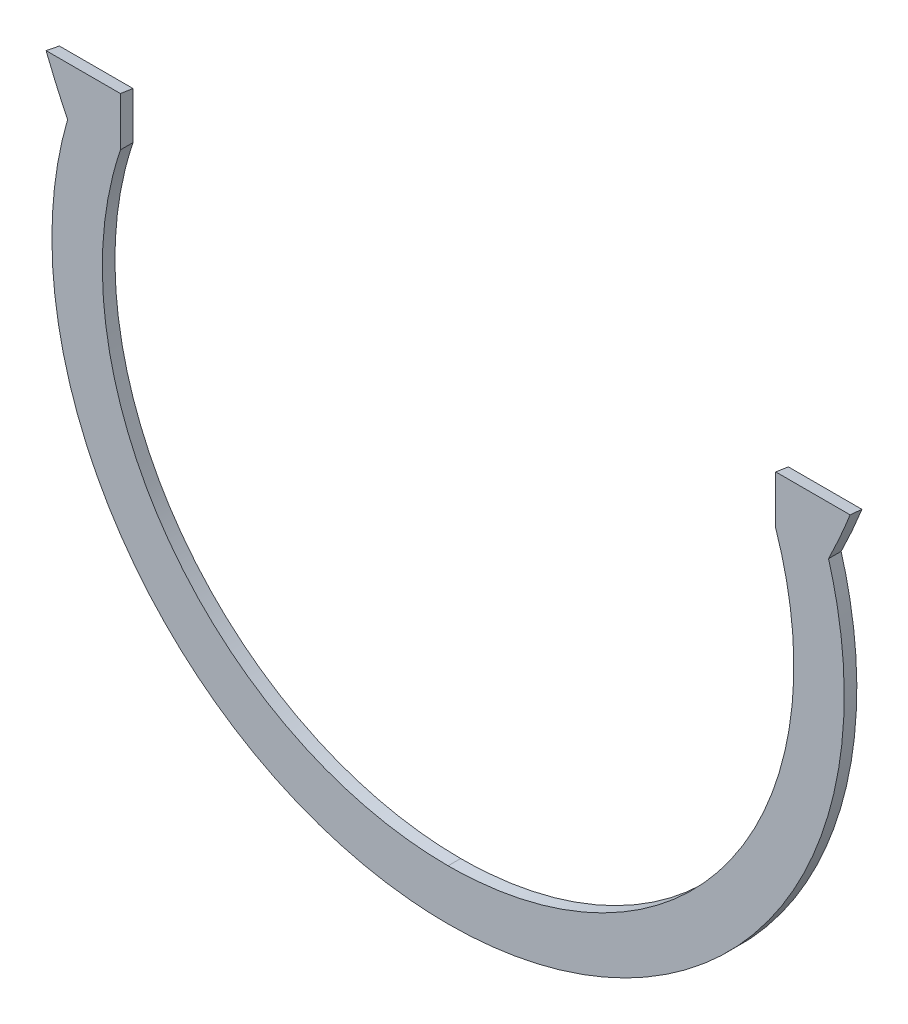
ISO-10303-21;
HEADER;
FILE_DESCRIPTION(('STEP AP214'),'2;1');
FILE_NAME('part.step','',(''),(''),'','','');
FILE_SCHEMA(('AUTOMOTIVE_DESIGN { 1 0 10303 214 1 1 1 1 }'));
ENDSEC;
DATA;
#1=APPLICATION_CONTEXT('core data for automotive mechanical design processes');
#2=APPLICATION_PROTOCOL_DEFINITION('international standard','automotive_design',2000,#1);
#3=PRODUCT_CONTEXT('',#1,'mechanical');
#4=PRODUCT('Part','Part','',(#3));
#5=PRODUCT_RELATED_PRODUCT_CATEGORY('part','',(#4));
#6=PRODUCT_DEFINITION_FORMATION('','',#4);
#7=PRODUCT_DEFINITION_CONTEXT('part definition',#1,'design');
#8=PRODUCT_DEFINITION('design','',#6,#7);
#9=PRODUCT_DEFINITION_SHAPE('','',#8);
#10=(LENGTH_UNIT() NAMED_UNIT(*) SI_UNIT(.MILLI.,.METRE.));
#11=(NAMED_UNIT(*) PLANE_ANGLE_UNIT() SI_UNIT($,.RADIAN.));
#12=(NAMED_UNIT(*) SI_UNIT($,.STERADIAN.) SOLID_ANGLE_UNIT());
#13=UNCERTAINTY_MEASURE_WITH_UNIT(LENGTH_MEASURE(1.E-05),#10,'distance_accuracy_value','');
#14=(GEOMETRIC_REPRESENTATION_CONTEXT(3) GLOBAL_UNCERTAINTY_ASSIGNED_CONTEXT((#13)) GLOBAL_UNIT_ASSIGNED_CONTEXT((#10,
#11,#12)) REPRESENTATION_CONTEXT('',''));
#15=CARTESIAN_POINT('',(0.,0.,0.));
#16=DIRECTION('',(0.,0.,1.));
#17=DIRECTION('',(1.,0.,0.));
#18=AXIS2_PLACEMENT_3D('',#15,#16,#17);
#19=CARTESIAN_POINT('',(330.199999998664,-1904.86157691547,6.35));
#20=CARTESIAN_POINT('',(336.639292378157,-1923.96382584088,6.35));
#21=CARTESIAN_POINT('',(340.832967806029,-1943.68174918712,6.35));
#22=CARTESIAN_POINT('',(345.11624084571,-1963.82094472574,6.35));
#23=CARTESIAN_POINT('',(346.998050476947,-1984.32557625151,6.35));
#24=CARTESIAN_POINT('',(348.90699900396,-2005.12591944157,6.35));
#25=CARTESIAN_POINT('',(348.31740472374,-2026.00652688445,6.35));
#26=CARTESIAN_POINT('',(347.723543780599,-2047.03823910659,6.35));
#27=CARTESIAN_POINT('',(344.603158175214,-2067.84680935807,6.35));
#28=CARTESIAN_POINT('',(341.482937727115,-2088.65427824342,6.35));
#29=CARTESIAN_POINT('',(335.881411340609,-2108.93617534306,6.35));
#30=CARTESIAN_POINT('',(330.320731156412,-2129.07017731287,6.35));
#31=CARTESIAN_POINT('',(322.394206398882,-2148.39675876694,6.35));
#32=CARTESIAN_POINT('',(314.581242610894,-2167.44645401993,6.35));
#33=CARTESIAN_POINT('',(304.578626432106,-2185.44448519148,6.35));
#34=CARTESIAN_POINT('',(294.786215790542,-2203.06428673352,6.35));
#35=CARTESIAN_POINT('',(283.026600810078,-2219.43824890162,6.35));
#36=CARTESIAN_POINT('',(271.267654299251,-2235.81128029974,6.35));
#37=CARTESIAN_POINT('',(257.698302157418,-2250.71992192202,6.35));
#38=CARTESIAN_POINT('',(243.839238238036,-2265.94686975523,6.35));
#39=CARTESIAN_POINT('',(228.282491996413,-2279.43645087925,6.35));
#40=CARTESIAN_POINT('',(212.501391273664,-2293.12057448193,6.35));
#41=CARTESIAN_POINT('',(195.197604421026,-2304.82212706519,6.35));
#42=CARTESIAN_POINT('',(177.768593620015,-2316.60836137906,6.35));
#43=CARTESIAN_POINT('',(159.047015178597,-2326.21230617433,6.35));
#44=CARTESIAN_POINT('',(140.326422651031,-2335.81574520764,6.35));
#45=CARTESIAN_POINT('',(120.585280622746,-2343.09720593272,6.35));
#46=CARTESIAN_POINT('',(100.988090120464,-2350.32557057139,6.35));
#47=CARTESIAN_POINT('',(80.666622119461,-2355.16132813832,6.35));
#48=CARTESIAN_POINT('',(60.636297431214,-2359.92780436801,6.35));
#49=CARTESIAN_POINT('',(40.182855313118,-2362.30230481868,6.35));
#50=CARTESIAN_POINT('',(20.1589610124713,-2364.6269377957,6.35));
#51=CARTESIAN_POINT('',(-4.10782519111308E-12,-2364.6269377957,6.35));
#52=B_SPLINE_CURVE_WITH_KNOTS('',2,(#19,#20,#21,#22,#23,#24,#25,#26,#27,#28,#29,#30,#31,#32,#33,
#34,#35,#36,#37,#38,#39,#40,#41,#42,#43,#44,#45,#46,#47,#48,#49,#50,#51),.UNSPECIFIED.,.F.,.F.,
(3,2,2,2,2,2,2,2,2,2,2,2,2,2,2,2,3),(0.,0.0625,0.125,0.1875,0.25,0.3125,0.375,0.4375,0.5,0.5625,
0.625,0.6875,0.75,0.8125,0.875,0.9375,1.),.UNSPECIFIED.);
#53=DIRECTION('',(0.,0.,-1.));
#54=VECTOR('',#53,1.);
#55=SURFACE_OF_LINEAR_EXTRUSION('',#52,#54);
#56=CARTESIAN_POINT('',(330.199999998664,-1904.86157691547,-6.35));
#57=CARTESIAN_POINT('',(336.639292378157,-1923.96382584088,-6.35));
#58=CARTESIAN_POINT('',(340.832967806029,-1943.68174918712,-6.35));
#59=CARTESIAN_POINT('',(345.11624084571,-1963.82094472574,-6.35));
#60=CARTESIAN_POINT('',(346.998050476947,-1984.32557625151,-6.35));
#61=CARTESIAN_POINT('',(348.90699900396,-2005.12591944157,-6.35));
#62=CARTESIAN_POINT('',(348.31740472374,-2026.00652688445,-6.35));
#63=CARTESIAN_POINT('',(347.723543780599,-2047.03823910659,-6.35));
#64=CARTESIAN_POINT('',(344.603158175214,-2067.84680935807,-6.35));
#65=CARTESIAN_POINT('',(341.482937727115,-2088.65427824342,-6.35));
#66=CARTESIAN_POINT('',(335.881411340609,-2108.93617534306,-6.35));
#67=CARTESIAN_POINT('',(330.320731156412,-2129.07017731287,-6.35));
#68=CARTESIAN_POINT('',(322.394206398882,-2148.39675876694,-6.35));
#69=CARTESIAN_POINT('',(314.581242610894,-2167.44645401993,-6.35));
#70=CARTESIAN_POINT('',(304.578626432106,-2185.44448519148,-6.35));
#71=CARTESIAN_POINT('',(294.786215790542,-2203.06428673352,-6.35));
#72=CARTESIAN_POINT('',(283.026600810078,-2219.43824890162,-6.35));
#73=CARTESIAN_POINT('',(271.267654299251,-2235.81128029974,-6.35));
#74=CARTESIAN_POINT('',(257.698302157418,-2250.71992192202,-6.35));
#75=CARTESIAN_POINT('',(243.839238238036,-2265.94686975523,-6.35));
#76=CARTESIAN_POINT('',(228.282491996413,-2279.43645087925,-6.35));
#77=CARTESIAN_POINT('',(212.501391273664,-2293.12057448193,-6.35));
#78=CARTESIAN_POINT('',(195.197604421026,-2304.82212706519,-6.35));
#79=CARTESIAN_POINT('',(177.768593620015,-2316.60836137906,-6.35));
#80=CARTESIAN_POINT('',(159.047015178597,-2326.21230617433,-6.35));
#81=CARTESIAN_POINT('',(140.326422651031,-2335.81574520764,-6.35));
#82=CARTESIAN_POINT('',(120.585280622746,-2343.09720593272,-6.35));
#83=CARTESIAN_POINT('',(100.988090120464,-2350.32557057139,-6.35));
#84=CARTESIAN_POINT('',(80.666622119461,-2355.16132813832,-6.35));
#85=CARTESIAN_POINT('',(60.636297431214,-2359.92780436801,-6.35));
#86=CARTESIAN_POINT('',(40.182855313118,-2362.30230481868,-6.35));
#87=CARTESIAN_POINT('',(20.1589610124713,-2364.6269377957,-6.35));
#88=CARTESIAN_POINT('',(-4.10782519111308E-12,-2364.6269377957,-6.35));
#89=B_SPLINE_CURVE_WITH_KNOTS('',2,(#56,#57,#58,#59,#60,#61,#62,#63,#64,#65,#66,#67,#68,#69,#70,
#71,#72,#73,#74,#75,#76,#77,#78,#79,#80,#81,#82,#83,#84,#85,#86,#87,#88),.UNSPECIFIED.,.F.,.F.,
(3,2,2,2,2,2,2,2,2,2,2,2,2,2,2,2,3),(0.,0.0625,0.125,0.1875,0.25,0.3125,0.375,0.4375,0.5,0.5625,
0.625,0.6875,0.75,0.8125,0.875,0.9375,1.),.UNSPECIFIED.);
#90=CARTESIAN_POINT('',(330.199999998664,-1904.86157691547,-6.35));
#91=VERTEX_POINT('',#90);
#92=CARTESIAN_POINT('',(-4.21884749357559E-12,-2364.6269377957,-6.35));
#93=VERTEX_POINT('',#92);
#94=EDGE_CURVE('E258',#91,#93,#89,.T.);
#95=ORIENTED_EDGE('',*,*,#94,.T.);
#96=DIRECTION('',(0.,0.,-1.));
#97=VECTOR('',#96,1.);
#98=CARTESIAN_POINT('',(-4.21884749357559E-12,-2364.6269377957,6.35));
#99=LINE('',#98,#97);
#100=CARTESIAN_POINT('',(-4.21884749357559E-12,-2364.6269377957,6.35));
#101=VERTEX_POINT('',#100);
#102=EDGE_CURVE('E261',#101,#93,#99,.T.);
#103=ORIENTED_EDGE('',*,*,#102,.F.);
#104=CARTESIAN_POINT('',(330.199999998664,-1904.86157691547,6.35));
#105=VERTEX_POINT('',#104);
#106=EDGE_CURVE('E314',#105,#101,#52,.T.);
#107=ORIENTED_EDGE('',*,*,#106,.F.);
#108=DIRECTION('',(0.,0.,-1.));
#109=VECTOR('',#108,1.);
#110=CARTESIAN_POINT('',(330.199999998664,-1904.86157691547,6.35));
#111=LINE('',#110,#109);
#112=EDGE_CURVE('E263',#105,#91,#111,.T.);
#113=ORIENTED_EDGE('',*,*,#112,.T.);
#114=EDGE_LOOP('',(#95,#103,#107,#113));
#115=FACE_BOUND('',#114,.T.);
#116=ADVANCED_FACE('F36',(#115),#55,.F.);
#117=CARTESIAN_POINT('',(-4.21884749357559E-12,-2364.6269377957,6.35));
#118=CARTESIAN_POINT('',(-20.1583828890401,-2364.6269377957,6.35));
#119=CARTESIAN_POINT('',(-40.1828553131254,-2362.30230481868,6.35));
#120=CARTESIAN_POINT('',(-60.6351510161924,-2359.9280060087,6.35));
#121=CARTESIAN_POINT('',(-80.666622119468,-2355.16132813831,6.35));
#122=CARTESIAN_POINT('',(-100.986982990005,-2350.32590621745,6.35));
#123=CARTESIAN_POINT('',(-120.585280622753,-2343.09720593272,6.35));
#124=CARTESIAN_POINT('',(-140.325401863207,-2335.81619496403,6.35));
#125=CARTESIAN_POINT('',(-159.047015178604,-2326.21230617433,6.35));
#126=CARTESIAN_POINT('',(-177.767635503069,-2316.60892677312,6.35));
#127=CARTESIAN_POINT('',(-195.197604421033,-2304.82212706519,6.35));
#128=CARTESIAN_POINT('',(-212.500474341294,-2293.12127647376,6.35));
#129=CARTESIAN_POINT('',(-228.28249199642,-2279.43645087925,6.35));
#130=CARTESIAN_POINT('',(-243.838405798299,-2265.94768334687,6.35));
#131=CARTESIAN_POINT('',(-257.698302157424,-2250.71992192201,6.35));
#132=CARTESIAN_POINT('',(-271.266932458057,-2235.81217227322,6.35));
#133=CARTESIAN_POINT('',(-283.026600810083,-2219.43824890162,6.35));
#134=CARTESIAN_POINT('',(-294.785599992276,-2203.06525726851,6.35));
#135=CARTESIAN_POINT('',(-304.578626432111,-2185.44448519148,6.35));
#136=CARTESIAN_POINT('',(-314.58073730018,-2167.44750366813,6.35));
#137=CARTESIAN_POINT('',(-322.394206398886,-2148.39675876694,6.35));
#138=CARTESIAN_POINT('',(-330.320358030315,-2129.07127211422,6.35));
#139=CARTESIAN_POINT('',(-335.881411340612,-2108.93617534306,6.35));
#140=CARTESIAN_POINT('',(-341.482707367963,-2088.65537038372,6.35));
#141=CARTESIAN_POINT('',(-344.603158175217,-2067.84680935807,6.35));
#142=CARTESIAN_POINT('',(-347.723443786246,-2047.03934993469,6.35));
#143=CARTESIAN_POINT('',(-348.317404723742,-2026.00652688445,6.35));
#144=CARTESIAN_POINT('',(-348.907034488306,-2005.12707552608,6.35));
#145=CARTESIAN_POINT('',(-346.998050476948,-1984.32557625151,6.35));
#146=CARTESIAN_POINT('',(-345.116416180326,-1963.82209679684,6.35));
#147=CARTESIAN_POINT('',(-340.83296780603,-1943.68174918712,6.35));
#148=CARTESIAN_POINT('',(-336.639477242481,-1923.96437424342,6.35));
#149=CARTESIAN_POINT('',(-330.199999998664,-1904.86157691547,6.35));
#150=B_SPLINE_CURVE_WITH_KNOTS('',2,(#117,#118,#119,#120,#121,#122,#123,#124,#125,#126,#127,
#128,#129,#130,#131,#132,#133,#134,#135,#136,#137,#138,#139,#140,#141,#142,#143,#144,#145,#146,
#147,#148,#149),.UNSPECIFIED.,.F.,.F.,(3,2,2,2,2,2,2,2,2,2,2,2,2,2,2,2,3),(0.,0.0625,0.125,
0.1875,0.25,0.3125,0.375,0.4375,0.5,0.5625,0.625,0.6875,0.75,0.8125,0.875,0.9375,1.),.UNSPECIFIED.);
#151=DIRECTION('',(0.,0.,-1.));
#152=VECTOR('',#151,1.);
#153=SURFACE_OF_LINEAR_EXTRUSION('',#150,#152);
#154=CARTESIAN_POINT('',(-4.21884749357559E-12,-2364.6269377957,-6.35));
#155=CARTESIAN_POINT('',(-20.1583828890401,-2364.6269377957,-6.35));
#156=CARTESIAN_POINT('',(-40.1828553131254,-2362.30230481868,-6.35));
#157=CARTESIAN_POINT('',(-60.6351510161924,-2359.9280060087,-6.35));
#158=CARTESIAN_POINT('',(-80.666622119468,-2355.16132813831,-6.35));
#159=CARTESIAN_POINT('',(-100.986982990005,-2350.32590621745,-6.35));
#160=CARTESIAN_POINT('',(-120.585280622753,-2343.09720593272,-6.35));
#161=CARTESIAN_POINT('',(-140.325401863207,-2335.81619496403,-6.35));
#162=CARTESIAN_POINT('',(-159.047015178604,-2326.21230617433,-6.35));
#163=CARTESIAN_POINT('',(-177.767635503069,-2316.60892677312,-6.35));
#164=CARTESIAN_POINT('',(-195.197604421033,-2304.82212706519,-6.35));
#165=CARTESIAN_POINT('',(-212.500474341294,-2293.12127647376,-6.35));
#166=CARTESIAN_POINT('',(-228.28249199642,-2279.43645087925,-6.35));
#167=CARTESIAN_POINT('',(-243.838405798299,-2265.94768334687,-6.35));
#168=CARTESIAN_POINT('',(-257.698302157424,-2250.71992192201,-6.35));
#169=CARTESIAN_POINT('',(-271.266932458057,-2235.81217227322,-6.35));
#170=CARTESIAN_POINT('',(-283.026600810083,-2219.43824890162,-6.35));
#171=CARTESIAN_POINT('',(-294.785599992276,-2203.06525726851,-6.35));
#172=CARTESIAN_POINT('',(-304.578626432111,-2185.44448519148,-6.35));
#173=CARTESIAN_POINT('',(-314.58073730018,-2167.44750366813,-6.35));
#174=CARTESIAN_POINT('',(-322.394206398886,-2148.39675876694,-6.35));
#175=CARTESIAN_POINT('',(-330.320358030315,-2129.07127211422,-6.35));
#176=CARTESIAN_POINT('',(-335.881411340612,-2108.93617534306,-6.35));
#177=CARTESIAN_POINT('',(-341.482707367963,-2088.65537038372,-6.35));
#178=CARTESIAN_POINT('',(-344.603158175217,-2067.84680935807,-6.35));
#179=CARTESIAN_POINT('',(-347.723443786246,-2047.03934993469,-6.35));
#180=CARTESIAN_POINT('',(-348.317404723742,-2026.00652688445,-6.35));
#181=CARTESIAN_POINT('',(-348.907034488306,-2005.12707552608,-6.35));
#182=CARTESIAN_POINT('',(-346.998050476948,-1984.32557625151,-6.35));
#183=CARTESIAN_POINT('',(-345.116416180326,-1963.82209679684,-6.35));
#184=CARTESIAN_POINT('',(-340.83296780603,-1943.68174918712,-6.35));
#185=CARTESIAN_POINT('',(-336.639477242481,-1923.96437424342,-6.35));
#186=CARTESIAN_POINT('',(-330.199999998664,-1904.86157691547,-6.35));
#187=B_SPLINE_CURVE_WITH_KNOTS('',2,(#154,#155,#156,#157,#158,#159,#160,#161,#162,#163,#164,
#165,#166,#167,#168,#169,#170,#171,#172,#173,#174,#175,#176,#177,#178,#179,#180,#181,#182,#183,
#184,#185,#186),.UNSPECIFIED.,.F.,.F.,(3,2,2,2,2,2,2,2,2,2,2,2,2,2,2,2,3),(0.,0.0625,0.125,
0.1875,0.25,0.3125,0.375,0.4375,0.5,0.5625,0.625,0.6875,0.75,0.8125,0.875,0.9375,1.),.UNSPECIFIED.);
#188=CARTESIAN_POINT('',(-330.199999998664,-1904.86157691547,-6.35));
#189=VERTEX_POINT('',#188);
#190=EDGE_CURVE('E266',#93,#189,#187,.T.);
#191=ORIENTED_EDGE('',*,*,#190,.T.);
#192=DIRECTION('',(0.,0.,-1.));
#193=VECTOR('',#192,1.);
#194=CARTESIAN_POINT('',(-330.199999998664,-1904.86157691547,6.35));
#195=LINE('',#194,#193);
#196=CARTESIAN_POINT('',(-330.199999998664,-1904.86157691547,6.35));
#197=VERTEX_POINT('',#196);
#198=EDGE_CURVE('E325',#197,#189,#195,.T.);
#199=ORIENTED_EDGE('',*,*,#198,.F.);
#200=EDGE_CURVE('E140',#101,#197,#150,.T.);
#201=ORIENTED_EDGE('',*,*,#200,.F.);
#202=ORIENTED_EDGE('',*,*,#102,.T.);
#203=EDGE_LOOP('',(#191,#199,#201,#202));
#204=FACE_BOUND('',#203,.T.);
#205=ADVANCED_FACE('F248',(#204),#153,.F.);
#206=CARTESIAN_POINT('',(-330.199999998664,-1904.86157691547,6.35));
#207=DIRECTION('',(-1.,0.,0.));
#208=DIRECTION('',(0.,-1.,0.));
#209=AXIS2_PLACEMENT_3D('',#206,#207,#208);
#210=PLANE('',#209);
#211=DIRECTION('',(0.,1.,0.));
#212=VECTOR('',#211,1.);
#213=CARTESIAN_POINT('',(-330.199999998664,-1904.86157691547,-6.35));
#214=LINE('',#213,#212);
#215=CARTESIAN_POINT('',(-330.199999998664,-1857.65383528531,-6.35));
#216=VERTEX_POINT('',#215);
#217=EDGE_CURVE('E268',#189,#216,#214,.T.);
#218=ORIENTED_EDGE('',*,*,#217,.T.);
#219=DIRECTION('',(0.,0.15108837889357,0.988520258650936));
#220=VECTOR('',#219,1.);
#221=CARTESIAN_POINT('',(-330.199999998664,-1856.83468453872,-0.990573194121472));
#222=LINE('',#221,#220);
#223=CARTESIAN_POINT('',(-330.199999998664,-1856.68328238306,0.));
#224=VERTEX_POINT('',#223);
#225=EDGE_CURVE('E60',#216,#224,#222,.T.);
#226=ORIENTED_EDGE('',*,*,#225,.T.);
#227=DIRECTION('',(0.,0.151088207535715,0.988520284841765));
#228=VECTOR('',#227,1.);
#229=CARTESIAN_POINT('',(-330.199999998664,-1856.83468309453,-0.990564895008348));
#230=LINE('',#229,#228);
#231=CARTESIAN_POINT('',(-330.199999998664,-1855.71273060727,6.34999999999987));
#232=VERTEX_POINT('',#231);
#233=EDGE_CURVE('E148',#224,#232,#230,.T.);
#234=ORIENTED_EDGE('',*,*,#233,.T.);
#235=DIRECTION('',(0.,1.,0.));
#236=VECTOR('',#235,1.);
#237=CARTESIAN_POINT('',(-330.199999998664,-1904.86157691547,6.35));
#238=LINE('',#237,#236);
#239=EDGE_CURVE('E134',#197,#232,#238,.T.);
#240=ORIENTED_EDGE('',*,*,#239,.F.);
#241=ORIENTED_EDGE('',*,*,#198,.T.);
#242=EDGE_LOOP('',(#218,#226,#234,#240,#241));
#243=FACE_BOUND('',#242,.T.);
#244=ADVANCED_FACE('F154',(#243),#210,.F.);
#245=CARTESIAN_POINT('',(899415.636154596,435852.304829675,6.35));
#246=CARTESIAN_POINT('',(-914637.560509222,-407047.396113873,6.35));
#247=CARTESIAN_POINT('',(928281.075774953,370718.510964481,6.35));
#248=B_SPLINE_CURVE_WITH_KNOTS('',2,(#245,#246,#247),.UNSPECIFIED.,.F.,.F.,(3,3),(0.,1.),.UNSPECIFIED.);
#249=DIRECTION('',(0.,0.,-1.));
#250=VECTOR('',#249,1.);
#251=SURFACE_OF_LINEAR_EXTRUSION('',#248,#250);
#252=CARTESIAN_POINT('',(-405.159536172092,-1855.71273060726,6.34999999999994));
#253=VERTEX_POINT('',#252);
#254=CARTESIAN_POINT('',(-383.426440200652,-1904.86157679445,6.35));
#255=VERTEX_POINT('',#254);
#256=EDGE_CURVE('E145',#253,#255,#248,.T.);
#257=ORIENTED_EDGE('',*,*,#256,.F.);
#258=CARTESIAN_POINT('',(-405.159536172095,-1855.71273060726,6.34999999999987));
#259=CARTESIAN_POINT('',(-405.096047071125,-1855.87449060697,5.29165770057024));
#260=CARTESIAN_POINT('',(-405.032481677439,-1856.03624992147,4.2333198841887));
#261=CARTESIAN_POINT('',(-404.905198304636,-1856.35976718007,2.11665321752181));
#262=CARTESIAN_POINT('',(-404.841480325518,-1856.52152512416,1.05832436723645));
#263=CARTESIAN_POINT('',(-404.777686053684,-1856.68328238305,-8.13708392558864E-13));
#264=B_SPLINE_CURVE_WITH_KNOTS('',3,(#258,#259,#260,#261,#262,#263),.UNSPECIFIED.,.F.,.F.,(4,2,
4),(0.,3.21754100489463,6.43508200978935),.UNSPECIFIED.);
#265=CARTESIAN_POINT('',(-404.777686053684,-1856.68328238306,0.));
#266=VERTEX_POINT('',#265);
#267=EDGE_CURVE('E150',#253,#266,#264,.T.);
#268=ORIENTED_EDGE('',*,*,#267,.T.);
#269=CARTESIAN_POINT('',(-404.777685831554,-1856.68328294626,-3.68485753195202E-06));
#270=CARTESIAN_POINT('',(-404.713890437996,-1856.84504304935,-1.05834543239453));
#271=CARTESIAN_POINT('',(-404.650018590429,-1857.00680246249,-2.11668266575805));
#272=CARTESIAN_POINT('',(-404.522121987278,-1857.33031990884,-4.23334810413811));
#273=CARTESIAN_POINT('',(-404.458097231694,-1857.49207794207,-5.29167630915465));
#274=CARTESIAN_POINT('',(-404.393996022101,-1857.65383528533,-6.34999999999771));
#275=B_SPLINE_CURVE_WITH_KNOTS('',3,(#269,#270,#271,#272,#273,#274),.UNSPECIFIED.,.F.,.F.,(4,2,
4),(0.,3.2175939429264,6.4351878858528),.UNSPECIFIED.);
#276=CARTESIAN_POINT('',(-404.393996021639,-1857.65383528531,-6.34999999999998));
#277=VERTEX_POINT('',#276);
#278=EDGE_CURVE('E197',#266,#277,#275,.T.);
#279=ORIENTED_EDGE('',*,*,#278,.T.);
#280=CARTESIAN_POINT('',(899415.636154596,435852.304829675,-6.35));
#281=CARTESIAN_POINT('',(-914637.560509222,-407047.396113873,-6.35));
#282=CARTESIAN_POINT('',(928281.075774953,370718.510964481,-6.35));
#283=B_SPLINE_CURVE_WITH_KNOTS('',2,(#280,#281,#282),.UNSPECIFIED.,.F.,.F.,(3,3),(0.,1.),.UNSPECIFIED.);
#284=CARTESIAN_POINT('',(-383.426440200652,-1904.86157679445,-6.35));
#285=VERTEX_POINT('',#284);
#286=EDGE_CURVE('E283',#277,#285,#283,.T.);
#287=ORIENTED_EDGE('',*,*,#286,.T.);
#288=DIRECTION('',(0.,0.,-1.));
#289=VECTOR('',#288,1.);
#290=CARTESIAN_POINT('',(-383.426440200652,-1904.86157679445,6.35));
#291=LINE('',#290,#289);
#292=EDGE_CURVE('E322',#255,#285,#291,.T.);
#293=ORIENTED_EDGE('',*,*,#292,.F.);
#294=EDGE_LOOP('',(#257,#268,#279,#287,#293));
#295=FACE_BOUND('',#294,.T.);
#296=ADVANCED_FACE('F199',(#295),#251,.F.);
#297=CARTESIAN_POINT('',(-383.426440140892,-1904.86157691547,6.35));
#298=CARTESIAN_POINT('',(-389.727858863231,-1926.56807092514,6.35));
#299=CARTESIAN_POINT('',(-393.539272580176,-1948.84763007303,6.35));
#300=CARTESIAN_POINT('',(-397.428452831523,-1971.58177227897,6.35));
#301=CARTESIAN_POINT('',(-398.673862928734,-1994.61368936028,6.35));
#302=CARTESIAN_POINT('',(-399.936416676464,-2017.96265151624,6.35));
#303=CARTESIAN_POINT('',(-398.464608205623,-2041.30053402687,6.35));
#304=CARTESIAN_POINT('',(-396.982634476048,-2064.79960300892,6.35));
#305=CARTESIAN_POINT('',(-392.748597186456,-2087.96269690628,6.35));
#306=CARTESIAN_POINT('',(-388.514760225033,-2111.12469487088,6.35));
#307=CARTESIAN_POINT('',(-381.587441666418,-2133.6295211227,6.35));
#308=CARTESIAN_POINT('',(-374.708304699183,-2155.97781951553,6.35));
#309=CARTESIAN_POINT('',(-365.266900419249,-2177.37132247862,6.35));
#310=CARTESIAN_POINT('',(-355.954626792003,-2198.47222521837,6.35));
#311=CARTESIAN_POINT('',(-344.273824852739,-2218.36140638912,6.35));
#312=CARTESIAN_POINT('',(-332.827602432241,-2237.85116339603,6.35));
#313=CARTESIAN_POINT('',(-319.254139648132,-2255.92545309054,6.35));
#314=CARTESIAN_POINT('',(-305.68136590048,-2273.99882527089,6.35));
#315=CARTESIAN_POINT('',(-290.154708419724,-2290.42567561893,6.35));
#316=CARTESIAN_POINT('',(-274.311449684215,-2307.1874828911,6.35));
#317=CARTESIAN_POINT('',(-256.642493197213,-2322.01408538599,6.35));
#318=CARTESIAN_POINT('',(-238.730312092985,-2337.0447856565,6.35));
#319=CARTESIAN_POINT('',(-219.185000061054,-2349.88237310548,6.35));
#320=CARTESIAN_POINT('',(-199.504690342045,-2362.80862859978,6.35));
#321=CARTESIAN_POINT('',(-178.440416740165,-2373.33251503603,6.35));
#322=CARTESIAN_POINT('',(-157.377132642751,-2383.85590710761,6.35));
#323=CARTESIAN_POINT('',(-135.221900066219,-2391.83089450721,6.35));
#324=CARTESIAN_POINT('',(-113.220758743736,-2399.75041528939,6.35));
#325=CARTESIAN_POINT('',(-90.4444452493108,-2405.04773197239,6.35));
#326=CARTESIAN_POINT('',(-67.9796419976573,-2410.27259758001,6.35));
#327=CARTESIAN_POINT('',(-45.0614515498522,-2412.87589162882,6.35));
#328=CARTESIAN_POINT('',(-22.6032271628133,-2415.42693779569,6.35));
#329=CARTESIAN_POINT('',(-4.55191440096314E-12,-2415.42693779569,6.35));
#330=B_SPLINE_CURVE_WITH_KNOTS('',2,(#297,#298,#299,#300,#301,#302,#303,#304,#305,#306,#307,
#308,#309,#310,#311,#312,#313,#314,#315,#316,#317,#318,#319,#320,#321,#322,#323,#324,#325,#326,
#327,#328,#329),.UNSPECIFIED.,.F.,.F.,(3,2,2,2,2,2,2,2,2,2,2,2,2,2,2,2,3),(0.,0.0625,0.125,
0.1875,0.25,0.3125,0.375,0.4375,0.5,0.5625,0.625,0.6875,0.75,0.8125,0.875,0.9375,1.),.UNSPECIFIED.);
#331=DIRECTION('',(0.,0.,-1.));
#332=VECTOR('',#331,1.);
#333=SURFACE_OF_LINEAR_EXTRUSION('',#330,#332);
#334=CARTESIAN_POINT('',(-383.426440140892,-1904.86157691547,-6.35));
#335=CARTESIAN_POINT('',(-389.727858863231,-1926.56807092514,-6.35));
#336=CARTESIAN_POINT('',(-393.539272580176,-1948.84763007303,-6.35));
#337=CARTESIAN_POINT('',(-397.428452831523,-1971.58177227897,-6.35));
#338=CARTESIAN_POINT('',(-398.673862928734,-1994.61368936028,-6.35));
#339=CARTESIAN_POINT('',(-399.936416676464,-2017.96265151624,-6.35));
#340=CARTESIAN_POINT('',(-398.464608205623,-2041.30053402687,-6.35));
#341=CARTESIAN_POINT('',(-396.982634476048,-2064.79960300892,-6.35));
#342=CARTESIAN_POINT('',(-392.748597186456,-2087.96269690628,-6.35));
#343=CARTESIAN_POINT('',(-388.514760225033,-2111.12469487088,-6.35));
#344=CARTESIAN_POINT('',(-381.587441666418,-2133.6295211227,-6.35));
#345=CARTESIAN_POINT('',(-374.708304699183,-2155.97781951553,-6.35));
#346=CARTESIAN_POINT('',(-365.266900419249,-2177.37132247862,-6.35));
#347=CARTESIAN_POINT('',(-355.954626792003,-2198.47222521837,-6.35));
#348=CARTESIAN_POINT('',(-344.273824852739,-2218.36140638912,-6.35));
#349=CARTESIAN_POINT('',(-332.827602432241,-2237.85116339603,-6.35));
#350=CARTESIAN_POINT('',(-319.254139648132,-2255.92545309054,-6.35));
#351=CARTESIAN_POINT('',(-305.68136590048,-2273.99882527089,-6.35));
#352=CARTESIAN_POINT('',(-290.154708419724,-2290.42567561893,-6.35));
#353=CARTESIAN_POINT('',(-274.311449684215,-2307.1874828911,-6.35));
#354=CARTESIAN_POINT('',(-256.642493197213,-2322.01408538599,-6.35));
#355=CARTESIAN_POINT('',(-238.730312092985,-2337.0447856565,-6.35));
#356=CARTESIAN_POINT('',(-219.185000061054,-2349.88237310548,-6.35));
#357=CARTESIAN_POINT('',(-199.504690342045,-2362.80862859978,-6.35));
#358=CARTESIAN_POINT('',(-178.440416740165,-2373.33251503603,-6.35));
#359=CARTESIAN_POINT('',(-157.377132642751,-2383.85590710761,-6.35));
#360=CARTESIAN_POINT('',(-135.221900066219,-2391.83089450721,-6.35));
#361=CARTESIAN_POINT('',(-113.220758743736,-2399.75041528939,-6.35));
#362=CARTESIAN_POINT('',(-90.4444452493108,-2405.04773197239,-6.35));
#363=CARTESIAN_POINT('',(-67.9796419976573,-2410.27259758001,-6.35));
#364=CARTESIAN_POINT('',(-45.0614515498522,-2412.87589162882,-6.35));
#365=CARTESIAN_POINT('',(-22.6032271628133,-2415.42693779569,-6.35));
#366=CARTESIAN_POINT('',(-4.55191440096314E-12,-2415.42693779569,-6.35));
#367=B_SPLINE_CURVE_WITH_KNOTS('',2,(#334,#335,#336,#337,#338,#339,#340,#341,#342,#343,#344,
#345,#346,#347,#348,#349,#350,#351,#352,#353,#354,#355,#356,#357,#358,#359,#360,#361,#362,#363,
#364,#365,#366),.UNSPECIFIED.,.F.,.F.,(3,2,2,2,2,2,2,2,2,2,2,2,2,2,2,2,3),(0.,0.0625,0.125,
0.1875,0.25,0.3125,0.375,0.4375,0.5,0.5625,0.625,0.6875,0.75,0.8125,0.875,0.9375,1.),.UNSPECIFIED.);
#368=CARTESIAN_POINT('',(-4.55191440096314E-12,-2415.42693779569,-6.35));
#369=VERTEX_POINT('',#368);
#370=EDGE_CURVE('E287',#285,#369,#367,.T.);
#371=ORIENTED_EDGE('',*,*,#370,.T.);
#372=DIRECTION('',(0.,0.,-1.));
#373=VECTOR('',#372,1.);
#374=CARTESIAN_POINT('',(-4.55191440096314E-12,-2415.42693779569,6.35));
#375=LINE('',#374,#373);
#376=CARTESIAN_POINT('',(-4.55191440096314E-12,-2415.42693779569,6.35));
#377=VERTEX_POINT('',#376);
#378=EDGE_CURVE('E319',#377,#369,#375,.T.);
#379=ORIENTED_EDGE('',*,*,#378,.F.);
#380=EDGE_CURVE('E213',#255,#377,#330,.T.);
#381=ORIENTED_EDGE('',*,*,#380,.F.);
#382=ORIENTED_EDGE('',*,*,#292,.T.);
#383=EDGE_LOOP('',(#371,#379,#381,#382));
#384=FACE_BOUND('',#383,.T.);
#385=ADVANCED_FACE('F205',(#384),#333,.F.);
#386=CARTESIAN_POINT('',(-4.55191440096314E-12,-2415.42693779569,6.35));
#387=CARTESIAN_POINT('',(22.6026504713488,-2415.42693779569,6.35));
#388=CARTESIAN_POINT('',(45.0614515498433,-2412.87589162882,6.35));
#389=CARTESIAN_POINT('',(67.9784959327566,-2410.27279460575,6.35));
#390=CARTESIAN_POINT('',(90.4444452493022,-2405.04773197239,6.35));
#391=CARTESIAN_POINT('',(113.219651758659,-2399.75074323524,6.35));
#392=CARTESIAN_POINT('',(135.221900066211,-2391.83089450721,6.35));
#393=CARTESIAN_POINT('',(157.376112408015,-2383.85634536191,6.35));
#394=CARTESIAN_POINT('',(178.440416740157,-2373.33251503603,6.35));
#395=CARTESIAN_POINT('',(199.503726293716,-2362.80918170644,6.35));
#396=CARTESIAN_POINT('',(219.185000061046,-2349.88237310548,6.35));
#397=CARTESIAN_POINT('',(238.729383339664,-2337.04547520683,6.35));
#398=CARTESIAN_POINT('',(256.642493197205,-2322.014085386,6.35));
#399=CARTESIAN_POINT('',(274.310601539191,-2307.18828316643,6.35));
#400=CARTESIAN_POINT('',(290.154708419717,-2290.42567561893,6.35));
#401=CARTESIAN_POINT('',(305.680624793095,-2273.99970443957,6.35));
#402=CARTESIAN_POINT('',(319.254139648125,-2255.92545309055,6.35));
#403=CARTESIAN_POINT('',(332.826964109572,-2237.85212105736,6.35));
#404=CARTESIAN_POINT('',(344.273824852733,-2218.36140638912,6.35));
#405=CARTESIAN_POINT('',(355.954095040326,-2198.47326250563,6.35));
#406=CARTESIAN_POINT('',(365.266900419243,-2177.37132247862,6.35));
#407=CARTESIAN_POINT('',(374.7079010827,-2155.97890400864,6.35));
#408=CARTESIAN_POINT('',(381.587441666413,-2133.6295211227,6.35));
#409=CARTESIAN_POINT('',(388.514496554437,-2111.12577976374,6.35));
#410=CARTESIAN_POINT('',(392.748597186452,-2087.96269690628,6.35));
#411=CARTESIAN_POINT('',(396.982497568829,-2064.80070953506,6.35));
#412=CARTESIAN_POINT('',(398.46460820562,-2041.30053402687,6.35));
#413=CARTESIAN_POINT('',(399.936410379182,-2017.96380832405,6.35));
#414=CARTESIAN_POINT('',(398.673862928732,-1994.61368936028,6.35));
#415=CARTESIAN_POINT('',(397.428583429585,-1971.58293163482,6.35));
#416=CARTESIAN_POINT('',(393.539272580175,-1948.84763007303,6.35));
#417=CARTESIAN_POINT('',(389.728020477148,-1926.56862763653,6.35));
#418=CARTESIAN_POINT('',(383.426440140892,-1904.86157691547,6.35));
#419=B_SPLINE_CURVE_WITH_KNOTS('',2,(#386,#387,#388,#389,#390,#391,#392,#393,#394,#395,#396,
#397,#398,#399,#400,#401,#402,#403,#404,#405,#406,#407,#408,#409,#410,#411,#412,#413,#414,#415,
#416,#417,#418),.UNSPECIFIED.,.F.,.F.,(3,2,2,2,2,2,2,2,2,2,2,2,2,2,2,2,3),(0.,0.0625,0.125,
0.1875,0.25,0.3125,0.375,0.4375,0.5,0.5625,0.625,0.6875,0.75,0.8125,0.875,0.9375,1.),.UNSPECIFIED.);
#420=DIRECTION('',(0.,0.,-1.));
#421=VECTOR('',#420,1.);
#422=SURFACE_OF_LINEAR_EXTRUSION('',#419,#421);
#423=CARTESIAN_POINT('',(-4.55191440096314E-12,-2415.42693779569,-6.35));
#424=CARTESIAN_POINT('',(22.6026504713488,-2415.42693779569,-6.35));
#425=CARTESIAN_POINT('',(45.0614515498433,-2412.87589162882,-6.35));
#426=CARTESIAN_POINT('',(67.9784959327566,-2410.27279460575,-6.35));
#427=CARTESIAN_POINT('',(90.4444452493022,-2405.04773197239,-6.35));
#428=CARTESIAN_POINT('',(113.219651758659,-2399.75074323524,-6.35));
#429=CARTESIAN_POINT('',(135.221900066211,-2391.83089450721,-6.35));
#430=CARTESIAN_POINT('',(157.376112408015,-2383.85634536191,-6.35));
#431=CARTESIAN_POINT('',(178.440416740157,-2373.33251503603,-6.35));
#432=CARTESIAN_POINT('',(199.503726293716,-2362.80918170644,-6.35));
#433=CARTESIAN_POINT('',(219.185000061046,-2349.88237310548,-6.35));
#434=CARTESIAN_POINT('',(238.729383339664,-2337.04547520683,-6.35));
#435=CARTESIAN_POINT('',(256.642493197205,-2322.014085386,-6.35));
#436=CARTESIAN_POINT('',(274.310601539191,-2307.18828316643,-6.35));
#437=CARTESIAN_POINT('',(290.154708419717,-2290.42567561893,-6.35));
#438=CARTESIAN_POINT('',(305.680624793095,-2273.99970443957,-6.35));
#439=CARTESIAN_POINT('',(319.254139648125,-2255.92545309055,-6.35));
#440=CARTESIAN_POINT('',(332.826964109572,-2237.85212105736,-6.35));
#441=CARTESIAN_POINT('',(344.273824852733,-2218.36140638912,-6.35));
#442=CARTESIAN_POINT('',(355.954095040326,-2198.47326250563,-6.35));
#443=CARTESIAN_POINT('',(365.266900419243,-2177.37132247862,-6.35));
#444=CARTESIAN_POINT('',(374.7079010827,-2155.97890400864,-6.35));
#445=CARTESIAN_POINT('',(381.587441666413,-2133.6295211227,-6.35));
#446=CARTESIAN_POINT('',(388.514496554437,-2111.12577976374,-6.35));
#447=CARTESIAN_POINT('',(392.748597186452,-2087.96269690628,-6.35));
#448=CARTESIAN_POINT('',(396.982497568829,-2064.80070953506,-6.35));
#449=CARTESIAN_POINT('',(398.46460820562,-2041.30053402687,-6.35));
#450=CARTESIAN_POINT('',(399.936410379182,-2017.96380832405,-6.35));
#451=CARTESIAN_POINT('',(398.673862928732,-1994.61368936028,-6.35));
#452=CARTESIAN_POINT('',(397.428583429585,-1971.58293163482,-6.35));
#453=CARTESIAN_POINT('',(393.539272580175,-1948.84763007303,-6.35));
#454=CARTESIAN_POINT('',(389.728020477148,-1926.56862763653,-6.35));
#455=CARTESIAN_POINT('',(383.426440140892,-1904.86157691547,-6.35));
#456=B_SPLINE_CURVE_WITH_KNOTS('',2,(#423,#424,#425,#426,#427,#428,#429,#430,#431,#432,#433,
#434,#435,#436,#437,#438,#439,#440,#441,#442,#443,#444,#445,#446,#447,#448,#449,#450,#451,#452,
#453,#454,#455),.UNSPECIFIED.,.F.,.F.,(3,2,2,2,2,2,2,2,2,2,2,2,2,2,2,2,3),(0.,0.0625,0.125,
0.1875,0.25,0.3125,0.375,0.4375,0.5,0.5625,0.625,0.6875,0.75,0.8125,0.875,0.9375,1.),.UNSPECIFIED.);
#457=CARTESIAN_POINT('',(383.426440140892,-1904.86157691547,-6.35));
#458=VERTEX_POINT('',#457);
#459=EDGE_CURVE('E294',#369,#458,#456,.T.);
#460=ORIENTED_EDGE('',*,*,#459,.T.);
#461=DIRECTION('',(0.,0.,-1.));
#462=VECTOR('',#461,1.);
#463=CARTESIAN_POINT('',(383.426440140892,-1904.86157691547,6.35));
#464=LINE('',#463,#462);
#465=CARTESIAN_POINT('',(383.426440140892,-1904.86157691547,6.35));
#466=VERTEX_POINT('',#465);
#467=EDGE_CURVE('E316',#466,#458,#464,.T.);
#468=ORIENTED_EDGE('',*,*,#467,.F.);
#469=EDGE_CURVE('E222',#377,#466,#419,.T.);
#470=ORIENTED_EDGE('',*,*,#469,.F.);
#471=ORIENTED_EDGE('',*,*,#378,.T.);
#472=EDGE_LOOP('',(#460,#468,#470,#471));
#473=FACE_BOUND('',#472,.T.);
#474=ADVANCED_FACE('F237',(#473),#422,.F.);
#475=CARTESIAN_POINT('',(-928281.076127466,370718.510169026,6.35));
#476=CARTESIAN_POINT('',(914637.560509606,-407047.396112941,6.35));
#477=CARTESIAN_POINT('',(-899415.635802941,435852.305623324,6.35));
#478=B_SPLINE_CURVE_WITH_KNOTS('',2,(#475,#476,#477),.UNSPECIFIED.,.F.,.F.,(3,3),(0.,1.),.UNSPECIFIED.);
#479=DIRECTION('',(0.,0.,-1.));
#480=VECTOR('',#479,1.);
#481=SURFACE_OF_LINEAR_EXTRUSION('',#478,#480);
#482=CARTESIAN_POINT('',(-928281.076127466,370718.510169026,-6.35));
#483=CARTESIAN_POINT('',(914637.560509606,-407047.396112941,-6.35));
#484=CARTESIAN_POINT('',(-899415.635802941,435852.305623324,-6.35));
#485=B_SPLINE_CURVE_WITH_KNOTS('',2,(#482,#483,#484),.UNSPECIFIED.,.F.,.F.,(3,3),(0.,1.),.UNSPECIFIED.);
#486=CARTESIAN_POINT('',(404.393996019705,-1857.65383528648,-6.35));
#487=VERTEX_POINT('',#486);
#488=EDGE_CURVE('E301',#458,#487,#485,.T.);
#489=ORIENTED_EDGE('',*,*,#488,.T.);
#490=CARTESIAN_POINT('',(404.393996019705,-1857.65383528591,-6.35000000008677));
#491=CARTESIAN_POINT('',(404.458097267086,-1857.4920778485,-5.29167569513676));
#492=CARTESIAN_POINT('',(404.522122060298,-1857.33031972123,-4.2333468759899));
#493=CARTESIAN_POINT('',(404.650018738387,-1857.00680208694,-2.11668020930248));
#494=CARTESIAN_POINT('',(404.713890623262,-1856.84504257993,-1.05834236176191));
#495=CARTESIAN_POINT('',(404.777686053969,-1856.68328238306,-2.44994996512204E-11));
#496=B_SPLINE_CURVE_WITH_KNOTS('',3,(#490,#491,#492,#493,#494,#495),.UNSPECIFIED.,.F.,.F.,(4,2,
4),(0.,3.2175958102129,6.4351916204258),.UNSPECIFIED.);
#497=CARTESIAN_POINT('',(404.777686053972,-1856.68328238306,0.));
#498=VERTEX_POINT('',#497);
#499=EDGE_CURVE('E67',#487,#498,#496,.T.);
#500=ORIENTED_EDGE('',*,*,#499,.T.);
#501=CARTESIAN_POINT('',(405.15953617469,-1855.71273060728,6.34999999999985));
#502=CARTESIAN_POINT('',(405.096047073308,-1855.87449060698,5.29165770057051));
#503=CARTESIAN_POINT('',(405.032481679223,-1856.03624992147,4.23331988418921));
#504=CARTESIAN_POINT('',(404.905198305649,-1856.35976718006,2.1166532175227));
#505=CARTESIAN_POINT('',(404.84148032616,-1856.52152512416,1.05832436723748));
#506=CARTESIAN_POINT('',(404.777686053969,-1856.68328238306,3.0441313373731E-13));
#507=B_SPLINE_CURVE_WITH_KNOTS('',3,(#501,#502,#503,#504,#505,#506),.UNSPECIFIED.,.F.,.F.,(4,2,
4),(0.,3.2175410049615,6.43508200992301),.UNSPECIFIED.);
#508=CARTESIAN_POINT('',(405.159536174676,-1855.71273060729,6.3499999999107));
#509=VERTEX_POINT('',#508);
#510=EDGE_CURVE('E163',#509,#498,#507,.T.);
#511=ORIENTED_EDGE('',*,*,#510,.F.);
#512=EDGE_CURVE('E229',#466,#509,#478,.T.);
#513=ORIENTED_EDGE('',*,*,#512,.F.);
#514=ORIENTED_EDGE('',*,*,#467,.T.);
#515=EDGE_LOOP('',(#489,#500,#511,#513,#514));
#516=FACE_BOUND('',#515,.T.);
#517=ADVANCED_FACE('F176',(#516),#481,.F.);
#518=CARTESIAN_POINT('',(330.199999998664,-1856.6832829463,6.35));
#519=DIRECTION('',(1.,0.,0.));
#520=DIRECTION('',(0.,1.,0.));
#521=AXIS2_PLACEMENT_3D('',#518,#519,#520);
#522=PLANE('',#521);
#523=DIRECTION('',(0.,-1.,0.));
#524=VECTOR('',#523,1.);
#525=CARTESIAN_POINT('',(330.199999998664,-1856.6832829463,6.35));
#526=LINE('',#525,#524);
#527=CARTESIAN_POINT('',(330.199999998664,-1855.71273060727,6.34999999999986));
#528=VERTEX_POINT('',#527);
#529=EDGE_CURVE('E272',#528,#105,#526,.T.);
#530=ORIENTED_EDGE('',*,*,#529,.F.);
#531=DIRECTION('',(0.,0.151088207535715,0.988520284841765));
#532=VECTOR('',#531,1.);
#533=CARTESIAN_POINT('',(330.199999998664,-1855.73488603293,6.20504436088012));
#534=LINE('',#533,#532);
#535=CARTESIAN_POINT('',(330.199999998664,-1856.68328238306,0.));
#536=VERTEX_POINT('',#535);
#537=EDGE_CURVE('E157',#536,#528,#534,.T.);
#538=ORIENTED_EDGE('',*,*,#537,.F.);
#539=DIRECTION('',(0.,-0.15108837889357,-0.988520258650936));
#540=VECTOR('',#539,1.);
#541=CARTESIAN_POINT('',(330.199999998664,-1855.73488498243,6.20504403207495));
#542=LINE('',#541,#540);
#543=CARTESIAN_POINT('',(330.199999998664,-1857.65383528531,-6.34999999999998));
#544=VERTEX_POINT('',#543);
#545=EDGE_CURVE('E164',#536,#544,#542,.T.);
#546=ORIENTED_EDGE('',*,*,#545,.T.);
#547=DIRECTION('',(0.,-1.,0.));
#548=VECTOR('',#547,1.);
#549=CARTESIAN_POINT('',(330.199999998664,-1856.6832829463,-6.35));
#550=LINE('',#549,#548);
#551=EDGE_CURVE('E309',#544,#91,#550,.T.);
#552=ORIENTED_EDGE('',*,*,#551,.T.);
#553=ORIENTED_EDGE('',*,*,#112,.F.);
#554=EDGE_LOOP('',(#530,#538,#546,#552,#553));
#555=FACE_BOUND('',#554,.T.);
#556=ADVANCED_FACE('F244',(#555),#522,.F.);
#557=CARTESIAN_POINT('',(283.026600810078,-2219.43824890162,6.35));
#558=DIRECTION('',(0.,0.,1.));
#559=DIRECTION('',(1.,0.,0.));
#560=AXIS2_PLACEMENT_3D('',#557,#558,#559);
#561=PLANE('',#560);
#562=ORIENTED_EDGE('',*,*,#106,.T.);
#563=ORIENTED_EDGE('',*,*,#200,.T.);
#564=ORIENTED_EDGE('',*,*,#239,.T.);
#565=DIRECTION('',(1.,0.,0.));
#566=VECTOR('',#565,1.);
#567=CARTESIAN_POINT('',(-405.159536172092,-1855.71273060727,6.34999999999987));
#568=LINE('',#567,#566);
#569=EDGE_CURVE('E138',#253,#232,#568,.T.);
#570=ORIENTED_EDGE('',*,*,#569,.F.);
#571=ORIENTED_EDGE('',*,*,#256,.T.);
#572=ORIENTED_EDGE('',*,*,#380,.T.);
#573=ORIENTED_EDGE('',*,*,#469,.T.);
#574=ORIENTED_EDGE('',*,*,#512,.T.);
#575=DIRECTION('',(-1.,0.,0.));
#576=VECTOR('',#575,1.);
#577=CARTESIAN_POINT('',(405.159536174704,-1855.71273060727,6.34999999999986));
#578=LINE('',#577,#576);
#579=EDGE_CURVE('E160',#509,#528,#578,.T.);
#580=ORIENTED_EDGE('',*,*,#579,.T.);
#581=ORIENTED_EDGE('',*,*,#529,.T.);
#582=EDGE_LOOP('',(#562,#563,#564,#570,#571,#572,#573,#574,#580,#581));
#583=FACE_BOUND('',#582,.T.);
#584=ADVANCED_FACE('F137',(#583),#561,.T.);
#585=CARTESIAN_POINT('',(283.026600810078,-2219.43824890162,-6.35));
#586=DIRECTION('',(0.,0.,1.));
#587=DIRECTION('',(1.,0.,0.));
#588=AXIS2_PLACEMENT_3D('',#585,#586,#587);
#589=PLANE('',#588);
#590=ORIENTED_EDGE('',*,*,#286,.F.);
#591=DIRECTION('',(1.,0.,0.));
#592=VECTOR('',#591,1.);
#593=CARTESIAN_POINT('',(283.026600810078,-1857.65383528531,-6.35));
#594=LINE('',#593,#592);
#595=EDGE_CURVE('E11',#277,#216,#594,.T.);
#596=ORIENTED_EDGE('',*,*,#595,.T.);
#597=ORIENTED_EDGE('',*,*,#217,.F.);
#598=ORIENTED_EDGE('',*,*,#190,.F.);
#599=ORIENTED_EDGE('',*,*,#94,.F.);
#600=ORIENTED_EDGE('',*,*,#551,.F.);
#601=EDGE_CURVE('E52',#544,#487,#594,.T.);
#602=ORIENTED_EDGE('',*,*,#601,.T.);
#603=ORIENTED_EDGE('',*,*,#488,.F.);
#604=ORIENTED_EDGE('',*,*,#459,.F.);
#605=ORIENTED_EDGE('',*,*,#370,.F.);
#606=EDGE_LOOP('',(#590,#596,#597,#598,#599,#600,#602,#603,#604,#605));
#607=FACE_BOUND('',#606,.T.);
#608=ADVANCED_FACE('F332',(#607),#589,.F.);
#609=CARTESIAN_POINT('',(-404.777685831615,-1856.68328238306,0.));
#610=DIRECTION('',(0.,-0.988520258650936,0.15108837889357));
#611=DIRECTION('',(0.,-0.15108837889357,-0.988520258650936));
#612=AXIS2_PLACEMENT_3D('',#609,#610,#611);
#613=PLANE('',#612);
#614=ORIENTED_EDGE('',*,*,#601,.F.);
#615=ORIENTED_EDGE('',*,*,#545,.F.);
#616=ORIENTED_EDGE('',*,*,#537,.T.);
#617=ORIENTED_EDGE('',*,*,#579,.F.);
#618=ORIENTED_EDGE('',*,*,#510,.T.);
#619=ORIENTED_EDGE('',*,*,#499,.F.);
#620=EDGE_LOOP('',(#614,#615,#616,#617,#618,#619));
#621=FACE_BOUND('',#620,.T.);
#622=ADVANCED_FACE('F185',(#621),#613,.F.);
#623=ORIENTED_EDGE('',*,*,#595,.F.);
#624=ORIENTED_EDGE('',*,*,#278,.F.);
#625=ORIENTED_EDGE('',*,*,#267,.F.);
#626=ORIENTED_EDGE('',*,*,#569,.T.);
#627=ORIENTED_EDGE('',*,*,#233,.F.);
#628=ORIENTED_EDGE('',*,*,#225,.F.);
#629=EDGE_LOOP('',(#623,#624,#625,#626,#627,#628));
#630=FACE_BOUND('',#629,.T.);
#631=ADVANCED_FACE('F147',(#630),#613,.F.);
#632=CLOSED_SHELL('',(#116,#205,#244,#296,#385,#474,#517,#556,#584,#608,#622,#631));
#633=MANIFOLD_SOLID_BREP('B2',#632);
#634=ADVANCED_BREP_SHAPE_REPRESENTATION('',(#18,#633),#14);
#635=SHAPE_DEFINITION_REPRESENTATION(#9,#634);
ENDSEC;
END-ISO-10303-21;
